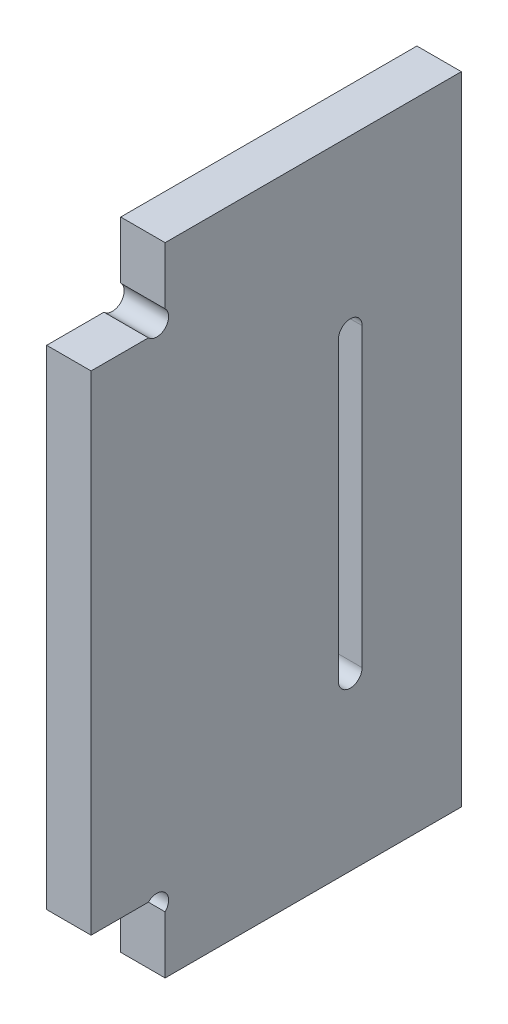
ISO-10303-21;
HEADER;
FILE_DESCRIPTION(('STEP AP214'),'2;1');
FILE_NAME('part.step','',(''),(''),'','','');
FILE_SCHEMA(('AUTOMOTIVE_DESIGN { 1 0 10303 214 1 1 1 1 }'));
ENDSEC;
DATA;
#1=APPLICATION_CONTEXT('core data for automotive mechanical design processes');
#2=APPLICATION_PROTOCOL_DEFINITION('international standard','automotive_design',2000,#1);
#3=PRODUCT_CONTEXT('',#1,'mechanical');
#4=PRODUCT('Part','Part','',(#3));
#5=PRODUCT_RELATED_PRODUCT_CATEGORY('part','',(#4));
#6=PRODUCT_DEFINITION_FORMATION('','',#4);
#7=PRODUCT_DEFINITION_CONTEXT('part definition',#1,'design');
#8=PRODUCT_DEFINITION('design','',#6,#7);
#9=PRODUCT_DEFINITION_SHAPE('','',#8);
#10=(LENGTH_UNIT() NAMED_UNIT(*) SI_UNIT(.MILLI.,.METRE.));
#11=(NAMED_UNIT(*) PLANE_ANGLE_UNIT() SI_UNIT($,.RADIAN.));
#12=(NAMED_UNIT(*) SI_UNIT($,.STERADIAN.) SOLID_ANGLE_UNIT());
#13=UNCERTAINTY_MEASURE_WITH_UNIT(LENGTH_MEASURE(1.E-05),#10,'distance_accuracy_value','');
#14=(GEOMETRIC_REPRESENTATION_CONTEXT(3) GLOBAL_UNCERTAINTY_ASSIGNED_CONTEXT((#13)) GLOBAL_UNIT_ASSIGNED_CONTEXT((#10,
#11,#12)) REPRESENTATION_CONTEXT('',''));
#15=CARTESIAN_POINT('',(0.,0.,0.));
#16=DIRECTION('',(0.,0.,1.));
#17=DIRECTION('',(1.,0.,0.));
#18=AXIS2_PLACEMENT_3D('',#15,#16,#17);
#19=CARTESIAN_POINT('',(6.,171.868629150102,-78.8686291501015));
#20=DIRECTION('',(1.,0.,0.));
#21=DIRECTION('',(0.,0.,-1.));
#22=AXIS2_PLACEMENT_3D('',#19,#20,#21);
#23=PLANE('',#22);
#24=DIRECTION('',(0.,-1.,0.));
#25=VECTOR('',#24,1.);
#26=CARTESIAN_POINT('',(6.,241.262741699797,-80.));
#27=LINE('',#26,#25);
#28=CARTESIAN_POINT('',(6.,249.,-80.));
#29=VERTEX_POINT('',#28);
#30=CARTESIAN_POINT('',(6.,241.262741699797,-80.));
#31=VERTEX_POINT('',#30);
#32=EDGE_CURVE('E299',#29,#31,#27,.T.);
#33=ORIENTED_EDGE('',*,*,#32,.T.);
#34=CARTESIAN_POINT('',(6.,240.131370849899,-78.8686291501015));
#35=DIRECTION('',(-1.,0.,0.));
#36=DIRECTION('',(0.,0.,1.));
#37=AXIS2_PLACEMENT_3D('',#34,#35,#36);
#38=CIRCLE('',#37,1.6);
#39=CARTESIAN_POINT('',(6.,239.,-77.737258300203));
#40=VERTEX_POINT('',#39);
#41=EDGE_CURVE('E302',#31,#40,#38,.T.);
#42=ORIENTED_EDGE('',*,*,#41,.T.);
#43=DIRECTION('',(0.,0.,1.));
#44=VECTOR('',#43,1.);
#45=CARTESIAN_POINT('',(6.,239.,-77.737258300203));
#46=LINE('',#45,#44);
#47=CARTESIAN_POINT('',(6.,239.,-70.));
#48=VERTEX_POINT('',#47);
#49=EDGE_CURVE('E304',#40,#48,#46,.T.);
#50=ORIENTED_EDGE('',*,*,#49,.T.);
#51=DIRECTION('',(0.,-1.,0.));
#52=VECTOR('',#51,1.);
#53=CARTESIAN_POINT('',(6.,173.,-70.));
#54=LINE('',#53,#52);
#55=CARTESIAN_POINT('',(6.,173.,-70.));
#56=VERTEX_POINT('',#55);
#57=EDGE_CURVE('E306',#48,#56,#54,.T.);
#58=ORIENTED_EDGE('',*,*,#57,.T.);
#59=DIRECTION('',(0.,0.,-1.));
#60=VECTOR('',#59,1.);
#61=CARTESIAN_POINT('',(6.,173.,-77.737258300203));
#62=LINE('',#61,#60);
#63=CARTESIAN_POINT('',(6.,173.,-77.737258300203));
#64=VERTEX_POINT('',#63);
#65=EDGE_CURVE('E308',#56,#64,#62,.T.);
#66=ORIENTED_EDGE('',*,*,#65,.T.);
#67=CARTESIAN_POINT('',(6.,171.868629150102,-78.8686291501015));
#68=DIRECTION('',(-1.,0.,0.));
#69=DIRECTION('',(0.,0.,-1.));
#70=AXIS2_PLACEMENT_3D('',#67,#68,#69);
#71=CIRCLE('',#70,1.6);
#72=CARTESIAN_POINT('',(6.,170.737258300203,-80.));
#73=VERTEX_POINT('',#72);
#74=EDGE_CURVE('E310',#64,#73,#71,.T.);
#75=ORIENTED_EDGE('',*,*,#74,.T.);
#76=DIRECTION('',(0.,-1.,0.));
#77=VECTOR('',#76,1.);
#78=CARTESIAN_POINT('',(6.,163.,-80.));
#79=LINE('',#78,#77);
#80=CARTESIAN_POINT('',(6.,163.,-80.));
#81=VERTEX_POINT('',#80);
#82=EDGE_CURVE('E312',#73,#81,#79,.T.);
#83=ORIENTED_EDGE('',*,*,#82,.T.);
#84=DIRECTION('',(0.,0.,-1.));
#85=VECTOR('',#84,1.);
#86=CARTESIAN_POINT('',(6.,163.,-80.));
#87=LINE('',#86,#85);
#88=CARTESIAN_POINT('',(6.,163.,-120.));
#89=VERTEX_POINT('',#88);
#90=EDGE_CURVE('E314',#81,#89,#87,.T.);
#91=ORIENTED_EDGE('',*,*,#90,.T.);
#92=DIRECTION('',(0.,1.,0.));
#93=VECTOR('',#92,1.);
#94=CARTESIAN_POINT('',(6.,163.,-120.));
#95=LINE('',#94,#93);
#96=CARTESIAN_POINT('',(6.,249.,-120.));
#97=VERTEX_POINT('',#96);
#98=EDGE_CURVE('E316',#89,#97,#95,.T.);
#99=ORIENTED_EDGE('',*,*,#98,.T.);
#100=DIRECTION('',(0.,0.,1.));
#101=VECTOR('',#100,1.);
#102=CARTESIAN_POINT('',(6.,249.,-120.));
#103=LINE('',#102,#101);
#104=EDGE_CURVE('E318',#97,#29,#103,.T.);
#105=ORIENTED_EDGE('',*,*,#104,.T.);
#106=EDGE_LOOP('',(#33,#42,#50,#58,#66,#75,#83,#91,#99,#105));
#107=FACE_BOUND('',#106,.T.);
#108=DIRECTION('',(0.,1.,0.));
#109=VECTOR('',#108,1.);
#110=CARTESIAN_POINT('',(6.,226.,-106.6));
#111=LINE('',#110,#109);
#112=CARTESIAN_POINT('',(6.,186.,-106.6));
#113=VERTEX_POINT('',#112);
#114=CARTESIAN_POINT('',(6.,226.,-106.6));
#115=VERTEX_POINT('',#114);
#116=EDGE_CURVE('E261',#113,#115,#111,.T.);
#117=ORIENTED_EDGE('',*,*,#116,.F.);
#118=CARTESIAN_POINT('',(6.,186.,-105.));
#119=DIRECTION('',(1.,0.,0.));
#120=DIRECTION('',(0.,0.,-1.));
#121=AXIS2_PLACEMENT_3D('',#118,#119,#120);
#122=CIRCLE('',#121,1.59999999999998);
#123=CARTESIAN_POINT('',(6.,186.,-103.4));
#124=VERTEX_POINT('',#123);
#125=EDGE_CURVE('E259',#124,#113,#122,.T.);
#126=ORIENTED_EDGE('',*,*,#125,.F.);
#127=DIRECTION('',(0.,-1.,0.));
#128=VECTOR('',#127,1.);
#129=CARTESIAN_POINT('',(6.,186.,-103.4));
#130=LINE('',#129,#128);
#131=CARTESIAN_POINT('',(6.,226.,-103.4));
#132=VERTEX_POINT('',#131);
#133=EDGE_CURVE('E266',#132,#124,#130,.T.);
#134=ORIENTED_EDGE('',*,*,#133,.F.);
#135=CARTESIAN_POINT('',(6.,226.,-105.));
#136=DIRECTION('',(1.,0.,0.));
#137=DIRECTION('',(0.,0.,-1.));
#138=AXIS2_PLACEMENT_3D('',#135,#136,#137);
#139=CIRCLE('',#138,1.59999999999999);
#140=EDGE_CURVE('E263',#115,#132,#139,.T.);
#141=ORIENTED_EDGE('',*,*,#140,.F.);
#142=EDGE_LOOP('',(#117,#126,#134,#141));
#143=FACE_BOUND('',#142,.T.);
#144=ADVANCED_FACE('F28',(#107,#143),#23,.T.);
#145=CARTESIAN_POINT('',(0.,171.868629150102,-78.8686291501015));
#146=DIRECTION('',(1.,0.,0.));
#147=DIRECTION('',(0.,0.,-1.));
#148=AXIS2_PLACEMENT_3D('',#145,#146,#147);
#149=PLANE('',#148);
#150=DIRECTION('',(0.,1.,0.));
#151=VECTOR('',#150,1.);
#152=CARTESIAN_POINT('',(0.,245.,-92.45));
#153=LINE('',#152,#151);
#154=CARTESIAN_POINT('',(0.,167.,-92.45));
#155=VERTEX_POINT('',#154);
#156=CARTESIAN_POINT('',(0.,245.,-92.45));
#157=VERTEX_POINT('',#156);
#158=EDGE_CURVE('E192',#155,#157,#153,.T.);
#159=ORIENTED_EDGE('',*,*,#158,.F.);
#160=CARTESIAN_POINT('',(0.,167.,-94.));
#161=DIRECTION('',(-1.,0.,0.));
#162=DIRECTION('',(0.,0.,-1.));
#163=AXIS2_PLACEMENT_3D('',#160,#161,#162);
#164=CIRCLE('',#163,1.55000000000001);
#165=CARTESIAN_POINT('',(0.,167.,-95.55));
#166=VERTEX_POINT('',#165);
#167=EDGE_CURVE('E43',#166,#155,#164,.T.);
#168=ORIENTED_EDGE('',*,*,#167,.F.);
#169=DIRECTION('',(0.,-1.,0.));
#170=VECTOR('',#169,1.);
#171=CARTESIAN_POINT('',(0.,167.,-95.55));
#172=LINE('',#171,#170);
#173=CARTESIAN_POINT('',(0.,245.,-95.5500000000001));
#174=VERTEX_POINT('',#173);
#175=EDGE_CURVE('E199',#174,#166,#172,.T.);
#176=ORIENTED_EDGE('',*,*,#175,.F.);
#177=CARTESIAN_POINT('',(0.,245.,-94.));
#178=DIRECTION('',(-1.,0.,0.));
#179=DIRECTION('',(0.,0.,1.));
#180=AXIS2_PLACEMENT_3D('',#177,#178,#179);
#181=CIRCLE('',#180,1.55);
#182=EDGE_CURVE('E181',#157,#174,#181,.T.);
#183=ORIENTED_EDGE('',*,*,#182,.F.);
#184=EDGE_LOOP('',(#159,#168,#176,#183));
#185=FACE_BOUND('',#184,.T.);
#186=DIRECTION('',(0.,1.,0.));
#187=VECTOR('',#186,1.);
#188=CARTESIAN_POINT('',(0.,167.,-114.45));
#189=LINE('',#188,#187);
#190=CARTESIAN_POINT('',(0.,167.,-114.45));
#191=VERTEX_POINT('',#190);
#192=CARTESIAN_POINT('',(0.,245.,-114.45));
#193=VERTEX_POINT('',#192);
#194=EDGE_CURVE('E218',#191,#193,#189,.T.);
#195=ORIENTED_EDGE('',*,*,#194,.F.);
#196=CARTESIAN_POINT('',(0.,167.,-116.));
#197=DIRECTION('',(-1.,0.,0.));
#198=DIRECTION('',(0.,0.,1.));
#199=AXIS2_PLACEMENT_3D('',#196,#197,#198);
#200=CIRCLE('',#199,1.55);
#201=CARTESIAN_POINT('',(0.,167.,-117.55));
#202=VERTEX_POINT('',#201);
#203=EDGE_CURVE('E51',#202,#191,#200,.T.);
#204=ORIENTED_EDGE('',*,*,#203,.F.);
#205=DIRECTION('',(0.,-1.,0.));
#206=VECTOR('',#205,1.);
#207=CARTESIAN_POINT('',(0.,245.,-117.55));
#208=LINE('',#207,#206);
#209=CARTESIAN_POINT('',(0.,245.,-117.55));
#210=VERTEX_POINT('',#209);
#211=EDGE_CURVE('E224',#210,#202,#208,.T.);
#212=ORIENTED_EDGE('',*,*,#211,.F.);
#213=CARTESIAN_POINT('',(0.,245.,-116.));
#214=DIRECTION('',(-1.,0.,0.));
#215=DIRECTION('',(0.,0.,-1.));
#216=AXIS2_PLACEMENT_3D('',#213,#214,#215);
#217=CIRCLE('',#216,1.55);
#218=EDGE_CURVE('E221',#193,#210,#217,.T.);
#219=ORIENTED_EDGE('',*,*,#218,.F.);
#220=EDGE_LOOP('',(#195,#204,#212,#219));
#221=FACE_BOUND('',#220,.T.);
#222=DIRECTION('',(0.,-1.,0.));
#223=VECTOR('',#222,1.);
#224=CARTESIAN_POINT('',(0.,241.262741699797,-80.));
#225=LINE('',#224,#223);
#226=CARTESIAN_POINT('',(0.,249.,-80.));
#227=VERTEX_POINT('',#226);
#228=CARTESIAN_POINT('',(0.,241.262741699797,-80.));
#229=VERTEX_POINT('',#228);
#230=EDGE_CURVE('E278',#227,#229,#225,.T.);
#231=ORIENTED_EDGE('',*,*,#230,.F.);
#232=DIRECTION('',(0.,0.,1.));
#233=VECTOR('',#232,1.);
#234=CARTESIAN_POINT('',(0.,249.,-120.));
#235=LINE('',#234,#233);
#236=CARTESIAN_POINT('',(0.,249.,-120.));
#237=VERTEX_POINT('',#236);
#238=EDGE_CURVE('E297',#237,#227,#235,.T.);
#239=ORIENTED_EDGE('',*,*,#238,.F.);
#240=DIRECTION('',(0.,1.,0.));
#241=VECTOR('',#240,1.);
#242=CARTESIAN_POINT('',(0.,163.,-120.));
#243=LINE('',#242,#241);
#244=CARTESIAN_POINT('',(0.,163.,-120.));
#245=VERTEX_POINT('',#244);
#246=EDGE_CURVE('E295',#245,#237,#243,.T.);
#247=ORIENTED_EDGE('',*,*,#246,.F.);
#248=DIRECTION('',(0.,0.,-1.));
#249=VECTOR('',#248,1.);
#250=CARTESIAN_POINT('',(0.,163.,-80.));
#251=LINE('',#250,#249);
#252=CARTESIAN_POINT('',(0.,163.,-80.));
#253=VERTEX_POINT('',#252);
#254=EDGE_CURVE('E293',#253,#245,#251,.T.);
#255=ORIENTED_EDGE('',*,*,#254,.F.);
#256=DIRECTION('',(0.,-1.,0.));
#257=VECTOR('',#256,1.);
#258=CARTESIAN_POINT('',(0.,163.,-80.));
#259=LINE('',#258,#257);
#260=CARTESIAN_POINT('',(0.,170.737258300203,-80.));
#261=VERTEX_POINT('',#260);
#262=EDGE_CURVE('E291',#261,#253,#259,.T.);
#263=ORIENTED_EDGE('',*,*,#262,.F.);
#264=CARTESIAN_POINT('',(0.,171.868629150102,-78.8686291501015));
#265=DIRECTION('',(-1.,0.,0.));
#266=DIRECTION('',(0.,0.,-1.));
#267=AXIS2_PLACEMENT_3D('',#264,#265,#266);
#268=CIRCLE('',#267,1.6);
#269=CARTESIAN_POINT('',(0.,173.,-77.737258300203));
#270=VERTEX_POINT('',#269);
#271=EDGE_CURVE('E289',#270,#261,#268,.T.);
#272=ORIENTED_EDGE('',*,*,#271,.F.);
#273=DIRECTION('',(0.,0.,-1.));
#274=VECTOR('',#273,1.);
#275=CARTESIAN_POINT('',(0.,173.,-77.737258300203));
#276=LINE('',#275,#274);
#277=CARTESIAN_POINT('',(0.,173.,-70.));
#278=VERTEX_POINT('',#277);
#279=EDGE_CURVE('E287',#278,#270,#276,.T.);
#280=ORIENTED_EDGE('',*,*,#279,.F.);
#281=DIRECTION('',(0.,-1.,0.));
#282=VECTOR('',#281,1.);
#283=CARTESIAN_POINT('',(0.,173.,-70.));
#284=LINE('',#283,#282);
#285=CARTESIAN_POINT('',(0.,239.,-70.));
#286=VERTEX_POINT('',#285);
#287=EDGE_CURVE('E285',#286,#278,#284,.T.);
#288=ORIENTED_EDGE('',*,*,#287,.F.);
#289=DIRECTION('',(0.,0.,1.));
#290=VECTOR('',#289,1.);
#291=CARTESIAN_POINT('',(0.,239.,-77.737258300203));
#292=LINE('',#291,#290);
#293=CARTESIAN_POINT('',(0.,239.,-77.737258300203));
#294=VERTEX_POINT('',#293);
#295=EDGE_CURVE('E283',#294,#286,#292,.T.);
#296=ORIENTED_EDGE('',*,*,#295,.F.);
#297=CARTESIAN_POINT('',(0.,240.131370849899,-78.8686291501015));
#298=DIRECTION('',(-1.,0.,0.));
#299=DIRECTION('',(0.,0.,1.));
#300=AXIS2_PLACEMENT_3D('',#297,#298,#299);
#301=CIRCLE('',#300,1.6);
#302=EDGE_CURVE('E281',#229,#294,#301,.T.);
#303=ORIENTED_EDGE('',*,*,#302,.F.);
#304=EDGE_LOOP('',(#231,#239,#247,#255,#263,#272,#280,#288,#296,#303));
#305=FACE_BOUND('',#304,.T.);
#306=CARTESIAN_POINT('',(0.,186.,-105.));
#307=DIRECTION('',(1.,0.,0.));
#308=DIRECTION('',(0.,0.,-1.));
#309=AXIS2_PLACEMENT_3D('',#306,#307,#308);
#310=CIRCLE('',#309,1.59999999999998);
#311=CARTESIAN_POINT('',(0.,186.,-103.4));
#312=VERTEX_POINT('',#311);
#313=CARTESIAN_POINT('',(0.,186.,-106.6));
#314=VERTEX_POINT('',#313);
#315=EDGE_CURVE('E242',#312,#314,#310,.T.);
#316=ORIENTED_EDGE('',*,*,#315,.T.);
#317=DIRECTION('',(0.,1.,0.));
#318=VECTOR('',#317,1.);
#319=CARTESIAN_POINT('',(0.,226.,-106.6));
#320=LINE('',#319,#318);
#321=CARTESIAN_POINT('',(0.,226.,-106.6));
#322=VERTEX_POINT('',#321);
#323=EDGE_CURVE('E250',#314,#322,#320,.T.);
#324=ORIENTED_EDGE('',*,*,#323,.T.);
#325=CARTESIAN_POINT('',(0.,226.,-105.));
#326=DIRECTION('',(1.,0.,0.));
#327=DIRECTION('',(0.,0.,-1.));
#328=AXIS2_PLACEMENT_3D('',#325,#326,#327);
#329=CIRCLE('',#328,1.59999999999999);
#330=CARTESIAN_POINT('',(0.,226.,-103.4));
#331=VERTEX_POINT('',#330);
#332=EDGE_CURVE('E253',#322,#331,#329,.T.);
#333=ORIENTED_EDGE('',*,*,#332,.T.);
#334=DIRECTION('',(0.,-1.,0.));
#335=VECTOR('',#334,1.);
#336=CARTESIAN_POINT('',(0.,186.,-103.4));
#337=LINE('',#336,#335);
#338=EDGE_CURVE('E256',#331,#312,#337,.T.);
#339=ORIENTED_EDGE('',*,*,#338,.T.);
#340=EDGE_LOOP('',(#316,#324,#333,#339));
#341=FACE_BOUND('',#340,.T.);
#342=ADVANCED_FACE('F196',(#185,#221,#305,#341),#149,.F.);
#343=CARTESIAN_POINT('',(6.,241.262741699797,-80.));
#344=DIRECTION('',(0.,0.,-1.));
#345=DIRECTION('',(-1.,0.,0.));
#346=AXIS2_PLACEMENT_3D('',#343,#344,#345);
#347=PLANE('',#346);
#348=ORIENTED_EDGE('',*,*,#230,.T.);
#349=DIRECTION('',(-1.,0.,0.));
#350=VECTOR('',#349,1.);
#351=CARTESIAN_POINT('',(6.,241.262741699797,-80.));
#352=LINE('',#351,#350);
#353=EDGE_CURVE('E11',#31,#229,#352,.T.);
#354=ORIENTED_EDGE('',*,*,#353,.F.);
#355=ORIENTED_EDGE('',*,*,#32,.F.);
#356=DIRECTION('',(-1.,0.,0.));
#357=VECTOR('',#356,1.);
#358=CARTESIAN_POINT('',(6.,249.,-80.));
#359=LINE('',#358,#357);
#360=EDGE_CURVE('E320',#29,#227,#359,.T.);
#361=ORIENTED_EDGE('',*,*,#360,.T.);
#362=EDGE_LOOP('',(#348,#354,#355,#361));
#363=FACE_BOUND('',#362,.T.);
#364=ADVANCED_FACE('F30',(#363),#347,.F.);
#365=CARTESIAN_POINT('',(6.,240.131370849899,-78.8686291501015));
#366=DIRECTION('',(-1.,0.,0.));
#367=DIRECTION('',(0.,0.,1.));
#368=AXIS2_PLACEMENT_3D('',#365,#366,#367);
#369=CYLINDRICAL_SURFACE('',#368,1.6);
#370=ORIENTED_EDGE('',*,*,#302,.T.);
#371=DIRECTION('',(-1.,0.,0.));
#372=VECTOR('',#371,1.);
#373=CARTESIAN_POINT('',(6.,239.,-77.737258300203));
#374=LINE('',#373,#372);
#375=EDGE_CURVE('E36',#40,#294,#374,.T.);
#376=ORIENTED_EDGE('',*,*,#375,.F.);
#377=ORIENTED_EDGE('',*,*,#41,.F.);
#378=ORIENTED_EDGE('',*,*,#353,.T.);
#379=EDGE_LOOP('',(#370,#376,#377,#378));
#380=FACE_BOUND('',#379,.T.);
#381=ADVANCED_FACE('F371',(#380),#369,.F.);
#382=CARTESIAN_POINT('',(6.,239.,-77.737258300203));
#383=DIRECTION('',(0.,-1.,0.));
#384=DIRECTION('',(0.,0.,-1.));
#385=AXIS2_PLACEMENT_3D('',#382,#383,#384);
#386=PLANE('',#385);
#387=ORIENTED_EDGE('',*,*,#295,.T.);
#388=DIRECTION('',(-1.,0.,0.));
#389=VECTOR('',#388,1.);
#390=CARTESIAN_POINT('',(6.,239.,-70.));
#391=LINE('',#390,#389);
#392=EDGE_CURVE('E341',#48,#286,#391,.T.);
#393=ORIENTED_EDGE('',*,*,#392,.F.);
#394=ORIENTED_EDGE('',*,*,#49,.F.);
#395=ORIENTED_EDGE('',*,*,#375,.T.);
#396=EDGE_LOOP('',(#387,#393,#394,#395));
#397=FACE_BOUND('',#396,.T.);
#398=ADVANCED_FACE('F348',(#397),#386,.F.);
#399=CARTESIAN_POINT('',(6.,173.,-70.));
#400=DIRECTION('',(0.,0.,-1.));
#401=DIRECTION('',(-1.,0.,0.));
#402=AXIS2_PLACEMENT_3D('',#399,#400,#401);
#403=PLANE('',#402);
#404=ORIENTED_EDGE('',*,*,#287,.T.);
#405=DIRECTION('',(-1.,0.,0.));
#406=VECTOR('',#405,1.);
#407=CARTESIAN_POINT('',(6.,173.,-70.));
#408=LINE('',#407,#406);
#409=EDGE_CURVE('E338',#56,#278,#408,.T.);
#410=ORIENTED_EDGE('',*,*,#409,.F.);
#411=ORIENTED_EDGE('',*,*,#57,.F.);
#412=ORIENTED_EDGE('',*,*,#392,.T.);
#413=EDGE_LOOP('',(#404,#410,#411,#412));
#414=FACE_BOUND('',#413,.T.);
#415=ADVANCED_FACE('F359',(#414),#403,.F.);
#416=CARTESIAN_POINT('',(6.,173.,-77.737258300203));
#417=DIRECTION('',(0.,1.,0.));
#418=DIRECTION('',(0.,0.,1.));
#419=AXIS2_PLACEMENT_3D('',#416,#417,#418);
#420=PLANE('',#419);
#421=ORIENTED_EDGE('',*,*,#279,.T.);
#422=DIRECTION('',(-1.,0.,0.));
#423=VECTOR('',#422,1.);
#424=CARTESIAN_POINT('',(6.,173.,-77.737258300203));
#425=LINE('',#424,#423);
#426=EDGE_CURVE('E335',#64,#270,#425,.T.);
#427=ORIENTED_EDGE('',*,*,#426,.F.);
#428=ORIENTED_EDGE('',*,*,#65,.F.);
#429=ORIENTED_EDGE('',*,*,#409,.T.);
#430=EDGE_LOOP('',(#421,#427,#428,#429));
#431=FACE_BOUND('',#430,.T.);
#432=ADVANCED_FACE('F363',(#431),#420,.F.);
#433=CARTESIAN_POINT('',(6.,171.868629150102,-78.8686291501015));
#434=DIRECTION('',(-1.,0.,0.));
#435=DIRECTION('',(0.,0.,1.));
#436=AXIS2_PLACEMENT_3D('',#433,#434,#435);
#437=CYLINDRICAL_SURFACE('',#436,1.6);
#438=ORIENTED_EDGE('',*,*,#271,.T.);
#439=DIRECTION('',(-1.,0.,0.));
#440=VECTOR('',#439,1.);
#441=CARTESIAN_POINT('',(6.,170.737258300203,-80.));
#442=LINE('',#441,#440);
#443=EDGE_CURVE('E332',#73,#261,#442,.T.);
#444=ORIENTED_EDGE('',*,*,#443,.F.);
#445=ORIENTED_EDGE('',*,*,#74,.F.);
#446=ORIENTED_EDGE('',*,*,#426,.T.);
#447=EDGE_LOOP('',(#438,#444,#445,#446));
#448=FACE_BOUND('',#447,.T.);
#449=ADVANCED_FACE('F394',(#448),#437,.F.);
#450=CARTESIAN_POINT('',(6.,163.,-80.));
#451=DIRECTION('',(0.,0.,-1.));
#452=DIRECTION('',(-1.,0.,0.));
#453=AXIS2_PLACEMENT_3D('',#450,#451,#452);
#454=PLANE('',#453);
#455=ORIENTED_EDGE('',*,*,#262,.T.);
#456=DIRECTION('',(-1.,0.,0.));
#457=VECTOR('',#456,1.);
#458=CARTESIAN_POINT('',(6.,163.,-80.));
#459=LINE('',#458,#457);
#460=EDGE_CURVE('E329',#81,#253,#459,.T.);
#461=ORIENTED_EDGE('',*,*,#460,.F.);
#462=ORIENTED_EDGE('',*,*,#82,.F.);
#463=ORIENTED_EDGE('',*,*,#443,.T.);
#464=EDGE_LOOP('',(#455,#461,#462,#463));
#465=FACE_BOUND('',#464,.T.);
#466=ADVANCED_FACE('F391',(#465),#454,.F.);
#467=CARTESIAN_POINT('',(6.,163.,-80.));
#468=DIRECTION('',(0.,1.,0.));
#469=DIRECTION('',(0.,0.,1.));
#470=AXIS2_PLACEMENT_3D('',#467,#468,#469);
#471=PLANE('',#470);
#472=ORIENTED_EDGE('',*,*,#254,.T.);
#473=DIRECTION('',(-1.,0.,0.));
#474=VECTOR('',#473,1.);
#475=CARTESIAN_POINT('',(6.,163.,-120.));
#476=LINE('',#475,#474);
#477=EDGE_CURVE('E326',#89,#245,#476,.T.);
#478=ORIENTED_EDGE('',*,*,#477,.F.);
#479=ORIENTED_EDGE('',*,*,#90,.F.);
#480=ORIENTED_EDGE('',*,*,#460,.T.);
#481=EDGE_LOOP('',(#472,#478,#479,#480));
#482=FACE_BOUND('',#481,.T.);
#483=ADVANCED_FACE('F387',(#482),#471,.F.);
#484=CARTESIAN_POINT('',(6.,163.,-120.));
#485=DIRECTION('',(0.,0.,1.));
#486=DIRECTION('',(1.,0.,0.));
#487=AXIS2_PLACEMENT_3D('',#484,#485,#486);
#488=PLANE('',#487);
#489=ORIENTED_EDGE('',*,*,#246,.T.);
#490=DIRECTION('',(-1.,0.,0.));
#491=VECTOR('',#490,1.);
#492=CARTESIAN_POINT('',(6.,249.,-120.));
#493=LINE('',#492,#491);
#494=EDGE_CURVE('E323',#97,#237,#493,.T.);
#495=ORIENTED_EDGE('',*,*,#494,.F.);
#496=ORIENTED_EDGE('',*,*,#98,.F.);
#497=ORIENTED_EDGE('',*,*,#477,.T.);
#498=EDGE_LOOP('',(#489,#495,#496,#497));
#499=FACE_BOUND('',#498,.T.);
#500=ADVANCED_FACE('F383',(#499),#488,.F.);
#501=CARTESIAN_POINT('',(6.,249.,-120.));
#502=DIRECTION('',(0.,-1.,0.));
#503=DIRECTION('',(0.,0.,-1.));
#504=AXIS2_PLACEMENT_3D('',#501,#502,#503);
#505=PLANE('',#504);
#506=ORIENTED_EDGE('',*,*,#238,.T.);
#507=ORIENTED_EDGE('',*,*,#360,.F.);
#508=ORIENTED_EDGE('',*,*,#104,.F.);
#509=ORIENTED_EDGE('',*,*,#494,.T.);
#510=EDGE_LOOP('',(#506,#507,#508,#509));
#511=FACE_BOUND('',#510,.T.);
#512=ADVANCED_FACE('F378',(#511),#505,.F.);
#513=CARTESIAN_POINT('',(6.,186.,-105.));
#514=DIRECTION('',(-1.,0.,0.));
#515=DIRECTION('',(0.,0.,1.));
#516=AXIS2_PLACEMENT_3D('',#513,#514,#515);
#517=CYLINDRICAL_SURFACE('',#516,1.59999999999998);
#518=ORIENTED_EDGE('',*,*,#315,.F.);
#519=DIRECTION('',(-1.,0.,0.));
#520=VECTOR('',#519,1.);
#521=CARTESIAN_POINT('',(6.,186.,-103.4));
#522=LINE('',#521,#520);
#523=EDGE_CURVE('E268',#124,#312,#522,.T.);
#524=ORIENTED_EDGE('',*,*,#523,.F.);
#525=ORIENTED_EDGE('',*,*,#125,.T.);
#526=DIRECTION('',(-1.,0.,0.));
#527=VECTOR('',#526,1.);
#528=CARTESIAN_POINT('',(6.,186.,-106.6));
#529=LINE('',#528,#527);
#530=EDGE_CURVE('E275',#113,#314,#529,.T.);
#531=ORIENTED_EDGE('',*,*,#530,.T.);
#532=EDGE_LOOP('',(#518,#524,#525,#531));
#533=FACE_BOUND('',#532,.T.);
#534=ADVANCED_FACE('F414',(#533),#517,.F.);
#535=CARTESIAN_POINT('',(6.,226.,-106.6));
#536=DIRECTION('',(0.,0.,1.));
#537=DIRECTION('',(1.,0.,0.));
#538=AXIS2_PLACEMENT_3D('',#535,#536,#537);
#539=PLANE('',#538);
#540=ORIENTED_EDGE('',*,*,#323,.F.);
#541=ORIENTED_EDGE('',*,*,#530,.F.);
#542=ORIENTED_EDGE('',*,*,#116,.T.);
#543=DIRECTION('',(-1.,0.,0.));
#544=VECTOR('',#543,1.);
#545=CARTESIAN_POINT('',(6.,226.,-106.6));
#546=LINE('',#545,#544);
#547=EDGE_CURVE('E273',#115,#322,#546,.T.);
#548=ORIENTED_EDGE('',*,*,#547,.T.);
#549=EDGE_LOOP('',(#540,#541,#542,#548));
#550=FACE_BOUND('',#549,.T.);
#551=ADVANCED_FACE('F436',(#550),#539,.T.);
#552=CARTESIAN_POINT('',(6.,226.,-105.));
#553=DIRECTION('',(-1.,0.,0.));
#554=DIRECTION('',(0.,0.,1.));
#555=AXIS2_PLACEMENT_3D('',#552,#553,#554);
#556=CYLINDRICAL_SURFACE('',#555,1.59999999999999);
#557=ORIENTED_EDGE('',*,*,#332,.F.);
#558=ORIENTED_EDGE('',*,*,#547,.F.);
#559=ORIENTED_EDGE('',*,*,#140,.T.);
#560=DIRECTION('',(-1.,0.,0.));
#561=VECTOR('',#560,1.);
#562=CARTESIAN_POINT('',(6.,226.,-103.4));
#563=LINE('',#562,#561);
#564=EDGE_CURVE('E271',#132,#331,#563,.T.);
#565=ORIENTED_EDGE('',*,*,#564,.T.);
#566=EDGE_LOOP('',(#557,#558,#559,#565));
#567=FACE_BOUND('',#566,.T.);
#568=ADVANCED_FACE('F443',(#567),#556,.F.);
#569=CARTESIAN_POINT('',(6.,186.,-103.4));
#570=DIRECTION('',(0.,0.,-1.));
#571=DIRECTION('',(0.,1.,0.));
#572=AXIS2_PLACEMENT_3D('',#569,#570,#571);
#573=PLANE('',#572);
#574=ORIENTED_EDGE('',*,*,#338,.F.);
#575=ORIENTED_EDGE('',*,*,#564,.F.);
#576=ORIENTED_EDGE('',*,*,#133,.T.);
#577=ORIENTED_EDGE('',*,*,#523,.T.);
#578=EDGE_LOOP('',(#574,#575,#576,#577));
#579=FACE_BOUND('',#578,.T.);
#580=ADVANCED_FACE('F451',(#579),#573,.T.);
#581=CARTESIAN_POINT('',(2.2,167.,-116.));
#582=DIRECTION('',(-1.,0.,0.));
#583=DIRECTION('',(0.,0.,1.));
#584=AXIS2_PLACEMENT_3D('',#581,#582,#583);
#585=CYLINDRICAL_SURFACE('',#584,1.55);
#586=ORIENTED_EDGE('',*,*,#203,.T.);
#587=DIRECTION('',(-1.,0.,0.));
#588=VECTOR('',#587,1.);
#589=CARTESIAN_POINT('',(2.2,167.,-114.45));
#590=LINE('',#589,#588);
#591=CARTESIAN_POINT('',(2.2,167.,-114.45));
#592=VERTEX_POINT('',#591);
#593=EDGE_CURVE('E239',#592,#191,#590,.T.);
#594=ORIENTED_EDGE('',*,*,#593,.F.);
#595=CARTESIAN_POINT('',(2.2,167.,-116.));
#596=DIRECTION('',(-1.,0.,0.));
#597=DIRECTION('',(0.,0.,1.));
#598=AXIS2_PLACEMENT_3D('',#595,#596,#597);
#599=CIRCLE('',#598,1.55);
#600=CARTESIAN_POINT('',(2.2,167.,-117.55));
#601=VERTEX_POINT('',#600);
#602=EDGE_CURVE('E227',#601,#592,#599,.T.);
#603=ORIENTED_EDGE('',*,*,#602,.F.);
#604=DIRECTION('',(-1.,0.,0.));
#605=VECTOR('',#604,1.);
#606=CARTESIAN_POINT('',(2.2,167.,-117.55));
#607=LINE('',#606,#605);
#608=EDGE_CURVE('E240',#601,#202,#607,.T.);
#609=ORIENTED_EDGE('',*,*,#608,.T.);
#610=EDGE_LOOP('',(#586,#594,#603,#609));
#611=FACE_BOUND('',#610,.T.);
#612=ADVANCED_FACE('F458',(#611),#585,.F.);
#613=CARTESIAN_POINT('',(2.2,245.,-117.55));
#614=DIRECTION('',(0.,0.,-1.));
#615=DIRECTION('',(-1.,0.,0.));
#616=AXIS2_PLACEMENT_3D('',#613,#614,#615);
#617=PLANE('',#616);
#618=ORIENTED_EDGE('',*,*,#211,.T.);
#619=ORIENTED_EDGE('',*,*,#608,.F.);
#620=DIRECTION('',(0.,-1.,0.));
#621=VECTOR('',#620,1.);
#622=CARTESIAN_POINT('',(2.2,245.,-117.55));
#623=LINE('',#622,#621);
#624=CARTESIAN_POINT('',(2.2,245.,-117.55));
#625=VERTEX_POINT('',#624);
#626=EDGE_CURVE('E236',#625,#601,#623,.T.);
#627=ORIENTED_EDGE('',*,*,#626,.F.);
#628=DIRECTION('',(-1.,0.,0.));
#629=VECTOR('',#628,1.);
#630=CARTESIAN_POINT('',(2.2,245.,-117.55));
#631=LINE('',#630,#629);
#632=EDGE_CURVE('E243',#625,#210,#631,.T.);
#633=ORIENTED_EDGE('',*,*,#632,.T.);
#634=EDGE_LOOP('',(#618,#619,#627,#633));
#635=FACE_BOUND('',#634,.T.);
#636=ADVANCED_FACE('F472',(#635),#617,.F.);
#637=CARTESIAN_POINT('',(2.2,245.,-116.));
#638=DIRECTION('',(-1.,0.,0.));
#639=DIRECTION('',(0.,0.,1.));
#640=AXIS2_PLACEMENT_3D('',#637,#638,#639);
#641=CYLINDRICAL_SURFACE('',#640,1.55);
#642=ORIENTED_EDGE('',*,*,#218,.T.);
#643=ORIENTED_EDGE('',*,*,#632,.F.);
#644=CARTESIAN_POINT('',(2.2,245.,-116.));
#645=DIRECTION('',(-1.,0.,0.));
#646=DIRECTION('',(0.,0.,-1.));
#647=AXIS2_PLACEMENT_3D('',#644,#645,#646);
#648=CIRCLE('',#647,1.55);
#649=CARTESIAN_POINT('',(2.2,245.,-114.45));
#650=VERTEX_POINT('',#649);
#651=EDGE_CURVE('E233',#650,#625,#648,.T.);
#652=ORIENTED_EDGE('',*,*,#651,.F.);
#653=DIRECTION('',(-1.,0.,0.));
#654=VECTOR('',#653,1.);
#655=CARTESIAN_POINT('',(2.2,245.,-114.45));
#656=LINE('',#655,#654);
#657=EDGE_CURVE('E245',#650,#193,#656,.T.);
#658=ORIENTED_EDGE('',*,*,#657,.T.);
#659=EDGE_LOOP('',(#642,#643,#652,#658));
#660=FACE_BOUND('',#659,.T.);
#661=ADVANCED_FACE('F479',(#660),#641,.F.);
#662=CARTESIAN_POINT('',(2.2,167.,-114.45));
#663=DIRECTION('',(0.,0.,1.));
#664=DIRECTION('',(1.,0.,0.));
#665=AXIS2_PLACEMENT_3D('',#662,#663,#664);
#666=PLANE('',#665);
#667=ORIENTED_EDGE('',*,*,#194,.T.);
#668=ORIENTED_EDGE('',*,*,#657,.F.);
#669=DIRECTION('',(0.,1.,0.));
#670=VECTOR('',#669,1.);
#671=CARTESIAN_POINT('',(2.2,167.,-114.45));
#672=LINE('',#671,#670);
#673=EDGE_CURVE('E230',#592,#650,#672,.T.);
#674=ORIENTED_EDGE('',*,*,#673,.F.);
#675=ORIENTED_EDGE('',*,*,#593,.T.);
#676=EDGE_LOOP('',(#667,#668,#674,#675));
#677=FACE_BOUND('',#676,.T.);
#678=ADVANCED_FACE('F487',(#677),#666,.F.);
#679=CARTESIAN_POINT('',(2.2,167.,-116.));
#680=DIRECTION('',(-1.,0.,0.));
#681=DIRECTION('',(0.,0.,1.));
#682=AXIS2_PLACEMENT_3D('',#679,#680,#681);
#683=PLANE('',#682);
#684=ORIENTED_EDGE('',*,*,#602,.T.);
#685=ORIENTED_EDGE('',*,*,#673,.T.);
#686=ORIENTED_EDGE('',*,*,#651,.T.);
#687=ORIENTED_EDGE('',*,*,#626,.T.);
#688=EDGE_LOOP('',(#684,#685,#686,#687));
#689=FACE_BOUND('',#688,.T.);
#690=ADVANCED_FACE('F495',(#689),#683,.T.);
#691=CARTESIAN_POINT('',(2.2,167.,-94.));
#692=DIRECTION('',(-1.,0.,0.));
#693=DIRECTION('',(0.,0.,1.));
#694=AXIS2_PLACEMENT_3D('',#691,#692,#693);
#695=CYLINDRICAL_SURFACE('',#694,1.55000000000001);
#696=ORIENTED_EDGE('',*,*,#167,.T.);
#697=DIRECTION('',(-1.,0.,0.));
#698=VECTOR('',#697,1.);
#699=CARTESIAN_POINT('',(2.2,167.,-92.45));
#700=LINE('',#699,#698);
#701=CARTESIAN_POINT('',(2.2,167.,-92.45));
#702=VERTEX_POINT('',#701);
#703=EDGE_CURVE('E189',#702,#155,#700,.T.);
#704=ORIENTED_EDGE('',*,*,#703,.F.);
#705=CARTESIAN_POINT('',(2.2,167.,-94.));
#706=DIRECTION('',(-1.,0.,0.));
#707=DIRECTION('',(0.,0.,-1.));
#708=AXIS2_PLACEMENT_3D('',#705,#706,#707);
#709=CIRCLE('',#708,1.55000000000001);
#710=CARTESIAN_POINT('',(2.2,167.,-95.55));
#711=VERTEX_POINT('',#710);
#712=EDGE_CURVE('E201',#711,#702,#709,.T.);
#713=ORIENTED_EDGE('',*,*,#712,.F.);
#714=DIRECTION('',(-1.,0.,0.));
#715=VECTOR('',#714,1.);
#716=CARTESIAN_POINT('',(2.2,167.,-95.55));
#717=LINE('',#716,#715);
#718=EDGE_CURVE('E213',#711,#166,#717,.T.);
#719=ORIENTED_EDGE('',*,*,#718,.T.);
#720=EDGE_LOOP('',(#696,#704,#713,#719));
#721=FACE_BOUND('',#720,.T.);
#722=ADVANCED_FACE('F503',(#721),#695,.F.);
#723=CARTESIAN_POINT('',(2.2,167.,-95.55));
#724=DIRECTION('',(0.,0.,-1.));
#725=DIRECTION('',(0.,1.,0.));
#726=AXIS2_PLACEMENT_3D('',#723,#724,#725);
#727=PLANE('',#726);
#728=ORIENTED_EDGE('',*,*,#175,.T.);
#729=ORIENTED_EDGE('',*,*,#718,.F.);
#730=DIRECTION('',(0.,-1.,0.));
#731=VECTOR('',#730,1.);
#732=CARTESIAN_POINT('',(2.2,167.,-95.55));
#733=LINE('',#732,#731);
#734=CARTESIAN_POINT('',(2.2,245.,-95.5500000000001));
#735=VERTEX_POINT('',#734);
#736=EDGE_CURVE('E210',#735,#711,#733,.T.);
#737=ORIENTED_EDGE('',*,*,#736,.F.);
#738=DIRECTION('',(-1.,0.,0.));
#739=VECTOR('',#738,1.);
#740=CARTESIAN_POINT('',(2.2,245.,-95.5500000000001));
#741=LINE('',#740,#739);
#742=EDGE_CURVE('E188',#735,#174,#741,.T.);
#743=ORIENTED_EDGE('',*,*,#742,.T.);
#744=EDGE_LOOP('',(#728,#729,#737,#743));
#745=FACE_BOUND('',#744,.T.);
#746=ADVANCED_FACE('F511',(#745),#727,.F.);
#747=CARTESIAN_POINT('',(2.2,245.,-94.));
#748=DIRECTION('',(-1.,0.,0.));
#749=DIRECTION('',(0.,0.,1.));
#750=AXIS2_PLACEMENT_3D('',#747,#748,#749);
#751=CYLINDRICAL_SURFACE('',#750,1.55);
#752=ORIENTED_EDGE('',*,*,#182,.T.);
#753=ORIENTED_EDGE('',*,*,#742,.F.);
#754=CARTESIAN_POINT('',(2.2,245.,-94.));
#755=DIRECTION('',(-1.,0.,0.));
#756=DIRECTION('',(0.,0.,1.));
#757=AXIS2_PLACEMENT_3D('',#754,#755,#756);
#758=CIRCLE('',#757,1.55);
#759=CARTESIAN_POINT('',(2.2,245.,-92.45));
#760=VERTEX_POINT('',#759);
#761=EDGE_CURVE('E184',#760,#735,#758,.T.);
#762=ORIENTED_EDGE('',*,*,#761,.F.);
#763=DIRECTION('',(-1.,0.,0.));
#764=VECTOR('',#763,1.);
#765=CARTESIAN_POINT('',(2.2,245.,-92.45));
#766=LINE('',#765,#764);
#767=EDGE_CURVE('E177',#760,#157,#766,.T.);
#768=ORIENTED_EDGE('',*,*,#767,.T.);
#769=EDGE_LOOP('',(#752,#753,#762,#768));
#770=FACE_BOUND('',#769,.T.);
#771=ADVANCED_FACE('F179',(#770),#751,.F.);
#772=CARTESIAN_POINT('',(2.2,245.,-92.45));
#773=DIRECTION('',(0.,0.,1.));
#774=DIRECTION('',(0.,-1.,0.));
#775=AXIS2_PLACEMENT_3D('',#772,#773,#774);
#776=PLANE('',#775);
#777=ORIENTED_EDGE('',*,*,#158,.T.);
#778=ORIENTED_EDGE('',*,*,#767,.F.);
#779=DIRECTION('',(0.,1.,0.));
#780=VECTOR('',#779,1.);
#781=CARTESIAN_POINT('',(2.2,245.,-92.45));
#782=LINE('',#781,#780);
#783=EDGE_CURVE('E207',#702,#760,#782,.T.);
#784=ORIENTED_EDGE('',*,*,#783,.F.);
#785=ORIENTED_EDGE('',*,*,#703,.T.);
#786=EDGE_LOOP('',(#777,#778,#784,#785));
#787=FACE_BOUND('',#786,.T.);
#788=ADVANCED_FACE('F193',(#787),#776,.F.);
#789=CARTESIAN_POINT('',(2.2,167.,-94.));
#790=DIRECTION('',(1.,0.,0.));
#791=DIRECTION('',(0.,0.,-1.));
#792=AXIS2_PLACEMENT_3D('',#789,#790,#791);
#793=PLANE('',#792);
#794=ORIENTED_EDGE('',*,*,#712,.T.);
#795=ORIENTED_EDGE('',*,*,#783,.T.);
#796=ORIENTED_EDGE('',*,*,#761,.T.);
#797=ORIENTED_EDGE('',*,*,#736,.T.);
#798=EDGE_LOOP('',(#794,#795,#796,#797));
#799=FACE_BOUND('',#798,.T.);
#800=ADVANCED_FACE('F531',(#799),#793,.F.);
#801=CLOSED_SHELL('',(#144,#342,#364,#381,#398,#415,#432,#449,#466,#483,#500,#512,#534,#551,
#568,#580,#612,#636,#661,#678,#690,#722,#746,#771,#788,#800));
#802=MANIFOLD_SOLID_BREP('B2',#801);
#803=ADVANCED_BREP_SHAPE_REPRESENTATION('',(#18,#802),#14);
#804=SHAPE_DEFINITION_REPRESENTATION(#9,#803);
ENDSEC;
END-ISO-10303-21;
